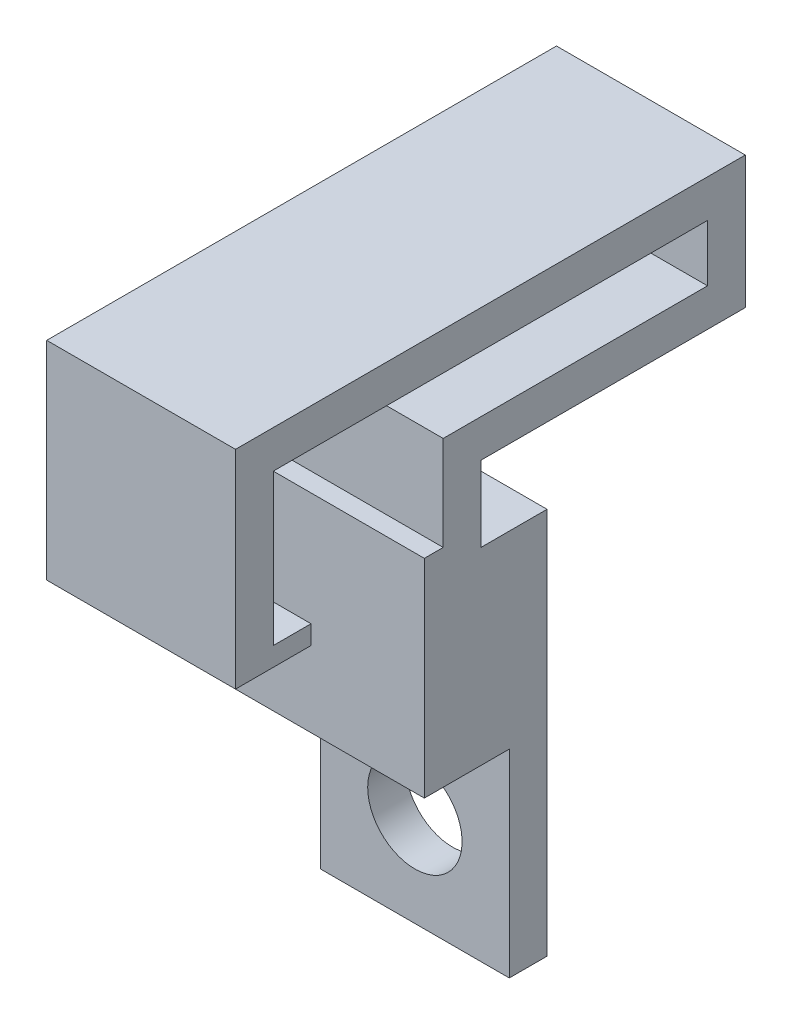
ISO-10303-21;
HEADER;
FILE_DESCRIPTION(('STEP AP214'),'2;1');
FILE_NAME('part.step','',(''),(''),'','','');
FILE_SCHEMA(('AUTOMOTIVE_DESIGN { 1 0 10303 214 1 1 1 1 }'));
ENDSEC;
DATA;
#1=APPLICATION_CONTEXT('core data for automotive mechanical design processes');
#2=APPLICATION_PROTOCOL_DEFINITION('international standard','automotive_design',2000,#1);
#3=PRODUCT_CONTEXT('',#1,'mechanical');
#4=PRODUCT('Part','Part','',(#3));
#5=PRODUCT_RELATED_PRODUCT_CATEGORY('part','',(#4));
#6=PRODUCT_DEFINITION_FORMATION('','',#4);
#7=PRODUCT_DEFINITION_CONTEXT('part definition',#1,'design');
#8=PRODUCT_DEFINITION('design','',#6,#7);
#9=PRODUCT_DEFINITION_SHAPE('','',#8);
#10=(LENGTH_UNIT() NAMED_UNIT(*) SI_UNIT(.MILLI.,.METRE.));
#11=(NAMED_UNIT(*) PLANE_ANGLE_UNIT() SI_UNIT($,.RADIAN.));
#12=(NAMED_UNIT(*) SI_UNIT($,.STERADIAN.) SOLID_ANGLE_UNIT());
#13=UNCERTAINTY_MEASURE_WITH_UNIT(LENGTH_MEASURE(1.E-05),#10,'distance_accuracy_value','');
#14=(GEOMETRIC_REPRESENTATION_CONTEXT(3) GLOBAL_UNCERTAINTY_ASSIGNED_CONTEXT((#13)) GLOBAL_UNIT_ASSIGNED_CONTEXT((#10,
#11,#12)) REPRESENTATION_CONTEXT('',''));
#15=CARTESIAN_POINT('',(0.,0.,0.));
#16=DIRECTION('',(0.,0.,1.));
#17=DIRECTION('',(1.,0.,0.));
#18=AXIS2_PLACEMENT_3D('',#15,#16,#17);
#19=CARTESIAN_POINT('',(0.,0.,-1.));
#20=DIRECTION('',(0.,0.,-1.));
#21=DIRECTION('',(-1.,0.,0.));
#22=AXIS2_PLACEMENT_3D('',#19,#20,#21);
#23=PLANE('',#22);
#24=DIRECTION('',(1.,0.,0.));
#25=VECTOR('',#24,1.);
#26=CARTESIAN_POINT('',(0.,9.,-1.));
#27=LINE('',#26,#25);
#28=CARTESIAN_POINT('',(-10.,9.,-1.));
#29=VERTEX_POINT('',#28);
#30=CARTESIAN_POINT('',(0.,9.,-1.));
#31=VERTEX_POINT('',#30);
#32=EDGE_CURVE('E302',#29,#31,#27,.T.);
#33=ORIENTED_EDGE('',*,*,#32,.F.);
#34=DIRECTION('',(0.,-1.,0.));
#35=VECTOR('',#34,1.);
#36=CARTESIAN_POINT('',(-10.,0.,-1.));
#37=LINE('',#36,#35);
#38=CARTESIAN_POINT('',(-10.,13.,-1.));
#39=VERTEX_POINT('',#38);
#40=EDGE_CURVE('E270',#39,#29,#37,.T.);
#41=ORIENTED_EDGE('',*,*,#40,.F.);
#42=DIRECTION('',(1.,0.,0.));
#43=VECTOR('',#42,1.);
#44=CARTESIAN_POINT('',(0.,13.,-1.));
#45=LINE('',#44,#43);
#46=CARTESIAN_POINT('',(0.,13.,-1.));
#47=VERTEX_POINT('',#46);
#48=EDGE_CURVE('E380',#39,#47,#45,.T.);
#49=ORIENTED_EDGE('',*,*,#48,.T.);
#50=DIRECTION('',(0.,-1.,0.));
#51=VECTOR('',#50,1.);
#52=CARTESIAN_POINT('',(0.,13.,-1.));
#53=LINE('',#52,#51);
#54=EDGE_CURVE('E377',#47,#31,#53,.T.);
#55=ORIENTED_EDGE('',*,*,#54,.T.);
#56=EDGE_LOOP('',(#33,#41,#49,#55));
#57=FACE_BOUND('',#56,.T.);
#58=ADVANCED_FACE('F41',(#57),#23,.T.);
#59=CARTESIAN_POINT('',(-10.,9.,10.));
#60=DIRECTION('',(0.,0.,1.));
#61=DIRECTION('',(1.,0.,0.));
#62=AXIS2_PLACEMENT_3D('',#59,#60,#61);
#63=PLANE('',#62);
#64=DIRECTION('',(0.,-1.,0.));
#65=VECTOR('',#64,1.);
#66=CARTESIAN_POINT('',(-10.,0.,10.));
#67=LINE('',#66,#65);
#68=CARTESIAN_POINT('',(-10.,18.,10.));
#69=VERTEX_POINT('',#68);
#70=CARTESIAN_POINT('',(-10.,10.,10.));
#71=VERTEX_POINT('',#70);
#72=EDGE_CURVE('E246',#69,#71,#67,.T.);
#73=ORIENTED_EDGE('',*,*,#72,.F.);
#74=DIRECTION('',(1.,0.,0.));
#75=VECTOR('',#74,1.);
#76=CARTESIAN_POINT('',(-10.,18.,10.));
#77=LINE('',#76,#75);
#78=CARTESIAN_POINT('',(0.,18.,10.));
#79=VERTEX_POINT('',#78);
#80=EDGE_CURVE('E365',#69,#79,#77,.T.);
#81=ORIENTED_EDGE('',*,*,#80,.T.);
#82=DIRECTION('',(0.,1.,0.));
#83=VECTOR('',#82,1.);
#84=CARTESIAN_POINT('',(0.,9.,10.));
#85=LINE('',#84,#83);
#86=CARTESIAN_POINT('',(0.,10.,10.));
#87=VERTEX_POINT('',#86);
#88=EDGE_CURVE('E215',#87,#79,#85,.T.);
#89=ORIENTED_EDGE('',*,*,#88,.F.);
#90=DIRECTION('',(1.,0.,0.));
#91=VECTOR('',#90,1.);
#92=CARTESIAN_POINT('',(0.,10.,10.));
#93=LINE('',#92,#91);
#94=EDGE_CURVE('E321',#71,#87,#93,.T.);
#95=ORIENTED_EDGE('',*,*,#94,.F.);
#96=EDGE_LOOP('',(#73,#81,#89,#95));
#97=FACE_BOUND('',#96,.T.);
#98=ADVANCED_FACE('F444',(#97),#63,.F.);
#99=CARTESIAN_POINT('',(-10.,18.,11.));
#100=DIRECTION('',(0.,1.,0.));
#101=DIRECTION('',(0.,0.,1.));
#102=AXIS2_PLACEMENT_3D('',#99,#100,#101);
#103=PLANE('',#102);
#104=DIRECTION('',(0.,0.,-1.));
#105=VECTOR('',#104,1.);
#106=CARTESIAN_POINT('',(-10.,18.,0.));
#107=LINE('',#106,#105);
#108=CARTESIAN_POINT('',(-10.,18.,-13.));
#109=VERTEX_POINT('',#108);
#110=EDGE_CURVE('E240',#69,#109,#107,.T.);
#111=ORIENTED_EDGE('',*,*,#110,.T.);
#112=DIRECTION('',(1.,0.,0.));
#113=VECTOR('',#112,1.);
#114=CARTESIAN_POINT('',(-10.,18.,-13.));
#115=LINE('',#114,#113);
#116=CARTESIAN_POINT('',(0.,18.,-13.));
#117=VERTEX_POINT('',#116);
#118=EDGE_CURVE('E210',#109,#117,#115,.T.);
#119=ORIENTED_EDGE('',*,*,#118,.T.);
#120=DIRECTION('',(0.,0.,-1.));
#121=VECTOR('',#120,1.);
#122=CARTESIAN_POINT('',(0.,18.,11.));
#123=LINE('',#122,#121);
#124=EDGE_CURVE('E214',#79,#117,#123,.T.);
#125=ORIENTED_EDGE('',*,*,#124,.F.);
#126=ORIENTED_EDGE('',*,*,#80,.F.);
#127=EDGE_LOOP('',(#111,#119,#125,#126));
#128=FACE_BOUND('',#127,.T.);
#129=ADVANCED_FACE('F450',(#128),#103,.F.);
#130=CARTESIAN_POINT('',(0.,10.,2.));
#131=DIRECTION('',(0.,-1.,0.));
#132=DIRECTION('',(1.,0.,0.));
#133=AXIS2_PLACEMENT_3D('',#130,#131,#132);
#134=PLANE('',#133);
#135=DIRECTION('',(0.,0.,-1.));
#136=VECTOR('',#135,1.);
#137=CARTESIAN_POINT('',(-10.,10.,0.));
#138=LINE('',#137,#136);
#139=CARTESIAN_POINT('',(-10.,10.,2.));
#140=VERTEX_POINT('',#139);
#141=CARTESIAN_POINT('',(-10.,10.,0.999999999999999));
#142=VERTEX_POINT('',#141);
#143=EDGE_CURVE('E180',#140,#142,#138,.T.);
#144=ORIENTED_EDGE('',*,*,#143,.F.);
#145=DIRECTION('',(-1.,0.,0.));
#146=VECTOR('',#145,1.);
#147=CARTESIAN_POINT('',(0.,10.,2.));
#148=LINE('',#147,#146);
#149=CARTESIAN_POINT('',(0.,10.,2.));
#150=VERTEX_POINT('',#149);
#151=EDGE_CURVE('E52',#150,#140,#148,.T.);
#152=ORIENTED_EDGE('',*,*,#151,.F.);
#153=DIRECTION('',(0.,0.,-1.));
#154=VECTOR('',#153,1.);
#155=CARTESIAN_POINT('',(0.,10.,2.));
#156=LINE('',#155,#154);
#157=CARTESIAN_POINT('',(0.,10.,0.999999999999999));
#158=VERTEX_POINT('',#157);
#159=EDGE_CURVE('E11',#150,#158,#156,.T.);
#160=ORIENTED_EDGE('',*,*,#159,.T.);
#161=DIRECTION('',(1.,0.,0.));
#162=VECTOR('',#161,1.);
#163=CARTESIAN_POINT('',(-10.,10.,0.999999999999999));
#164=LINE('',#163,#162);
#165=EDGE_CURVE('E208',#142,#158,#164,.T.);
#166=ORIENTED_EDGE('',*,*,#165,.F.);
#167=EDGE_LOOP('',(#144,#152,#160,#166));
#168=FACE_BOUND('',#167,.T.);
#169=ADVANCED_FACE('F176',(#168),#134,.F.);
#170=CARTESIAN_POINT('',(0.,0.,2.));
#171=DIRECTION('',(0.,0.,1.));
#172=DIRECTION('',(1.,0.,0.));
#173=AXIS2_PLACEMENT_3D('',#170,#171,#172);
#174=PLANE('',#173);
#175=ORIENTED_EDGE('',*,*,#151,.T.);
#176=DIRECTION('',(0.,1.,0.));
#177=VECTOR('',#176,1.);
#178=CARTESIAN_POINT('',(-10.,0.,2.));
#179=LINE('',#178,#177);
#180=CARTESIAN_POINT('',(-10.,-1.00000000000001,2.));
#181=VERTEX_POINT('',#180);
#182=EDGE_CURVE('E242',#181,#140,#179,.T.);
#183=ORIENTED_EDGE('',*,*,#182,.F.);
#184=DIRECTION('',(-1.,0.,0.));
#185=VECTOR('',#184,1.);
#186=CARTESIAN_POINT('',(0.,-1.,2.));
#187=LINE('',#186,#185);
#188=CARTESIAN_POINT('',(0.,-1.,2.));
#189=VERTEX_POINT('',#188);
#190=EDGE_CURVE('E190',#189,#181,#187,.T.);
#191=ORIENTED_EDGE('',*,*,#190,.F.);
#192=DIRECTION('',(0.,1.,0.));
#193=VECTOR('',#192,1.);
#194=CARTESIAN_POINT('',(0.,0.,2.));
#195=LINE('',#194,#193);
#196=EDGE_CURVE('E184',#189,#150,#195,.T.);
#197=ORIENTED_EDGE('',*,*,#196,.T.);
#198=EDGE_LOOP('',(#175,#183,#191,#197));
#199=FACE_BOUND('',#198,.T.);
#200=ADVANCED_FACE('F188',(#199),#174,.T.);
#201=CARTESIAN_POINT('',(-10.,15.,0.999999999999999));
#202=DIRECTION('',(0.,0.,-1.));
#203=DIRECTION('',(-1.,0.,0.));
#204=AXIS2_PLACEMENT_3D('',#201,#202,#203);
#205=PLANE('',#204);
#206=DIRECTION('',(0.,1.,0.));
#207=VECTOR('',#206,1.);
#208=CARTESIAN_POINT('',(-10.,0.,0.999999999999999));
#209=LINE('',#208,#207);
#210=CARTESIAN_POINT('',(-10.,15.,0.999999999999999));
#211=VERTEX_POINT('',#210);
#212=EDGE_CURVE('E80',#142,#211,#209,.T.);
#213=ORIENTED_EDGE('',*,*,#212,.F.);
#214=ORIENTED_EDGE('',*,*,#165,.T.);
#215=DIRECTION('',(0.,-1.,0.));
#216=VECTOR('',#215,1.);
#217=CARTESIAN_POINT('',(0.,15.,0.999999999999999));
#218=LINE('',#217,#216);
#219=CARTESIAN_POINT('',(0.,15.,0.999999999999999));
#220=VERTEX_POINT('',#219);
#221=EDGE_CURVE('E194',#220,#158,#218,.T.);
#222=ORIENTED_EDGE('',*,*,#221,.F.);
#223=DIRECTION('',(1.,0.,0.));
#224=VECTOR('',#223,1.);
#225=CARTESIAN_POINT('',(-10.,15.,0.999999999999999));
#226=LINE('',#225,#224);
#227=EDGE_CURVE('E205',#211,#220,#226,.T.);
#228=ORIENTED_EDGE('',*,*,#227,.F.);
#229=EDGE_LOOP('',(#213,#214,#222,#228));
#230=FACE_BOUND('',#229,.T.);
#231=ADVANCED_FACE('F235',(#230),#205,.F.);
#232=CARTESIAN_POINT('',(0.,15.,0.));
#233=DIRECTION('',(0.,1.,0.));
#234=DIRECTION('',(-1.,0.,0.));
#235=AXIS2_PLACEMENT_3D('',#232,#233,#234);
#236=PLANE('',#235);
#237=DIRECTION('',(1.,0.,0.));
#238=VECTOR('',#237,1.);
#239=CARTESIAN_POINT('',(-10.,15.,-13.));
#240=LINE('',#239,#238);
#241=CARTESIAN_POINT('',(-10.,15.,-13.));
#242=VERTEX_POINT('',#241);
#243=CARTESIAN_POINT('',(0.,15.,-13.));
#244=VERTEX_POINT('',#243);
#245=EDGE_CURVE('E216',#242,#244,#240,.T.);
#246=ORIENTED_EDGE('',*,*,#245,.F.);
#247=DIRECTION('',(0.,0.,-1.));
#248=VECTOR('',#247,1.);
#249=CARTESIAN_POINT('',(-10.,15.,0.));
#250=LINE('',#249,#248);
#251=EDGE_CURVE('E73',#211,#242,#250,.T.);
#252=ORIENTED_EDGE('',*,*,#251,.F.);
#253=ORIENTED_EDGE('',*,*,#227,.T.);
#254=DIRECTION('',(0.,0.,-1.));
#255=VECTOR('',#254,1.);
#256=CARTESIAN_POINT('',(0.,15.,0.));
#257=LINE('',#256,#255);
#258=EDGE_CURVE('E199',#220,#244,#257,.T.);
#259=ORIENTED_EDGE('',*,*,#258,.T.);
#260=EDGE_LOOP('',(#246,#252,#253,#259));
#261=FACE_BOUND('',#260,.T.);
#262=ADVANCED_FACE('F234',(#261),#236,.T.);
#263=CARTESIAN_POINT('',(0.,13.,0.));
#264=DIRECTION('',(0.,-1.,0.));
#265=DIRECTION('',(0.,0.,-1.));
#266=AXIS2_PLACEMENT_3D('',#263,#264,#265);
#267=PLANE('',#266);
#268=ORIENTED_EDGE('',*,*,#48,.F.);
#269=DIRECTION('',(0.,0.,1.));
#270=VECTOR('',#269,1.);
#271=CARTESIAN_POINT('',(-10.,13.,0.));
#272=LINE('',#271,#270);
#273=CARTESIAN_POINT('',(-10.,13.,-15.));
#274=VERTEX_POINT('',#273);
#275=EDGE_CURVE('E267',#274,#39,#272,.T.);
#276=ORIENTED_EDGE('',*,*,#275,.F.);
#277=DIRECTION('',(-1.,0.,0.));
#278=VECTOR('',#277,1.);
#279=CARTESIAN_POINT('',(0.,13.,-15.));
#280=LINE('',#279,#278);
#281=CARTESIAN_POINT('',(0.,13.,-15.));
#282=VERTEX_POINT('',#281);
#283=EDGE_CURVE('E354',#282,#274,#280,.T.);
#284=ORIENTED_EDGE('',*,*,#283,.F.);
#285=DIRECTION('',(0.,0.,1.));
#286=VECTOR('',#285,1.);
#287=CARTESIAN_POINT('',(0.,13.,-14.));
#288=LINE('',#287,#286);
#289=EDGE_CURVE('E220',#282,#47,#288,.T.);
#290=ORIENTED_EDGE('',*,*,#289,.T.);
#291=EDGE_LOOP('',(#268,#276,#284,#290));
#292=FACE_BOUND('',#291,.T.);
#293=ADVANCED_FACE('F390',(#292),#267,.T.);
#294=CARTESIAN_POINT('',(0.,9.,0.));
#295=DIRECTION('',(0.,-1.,0.));
#296=DIRECTION('',(0.,0.,-1.));
#297=AXIS2_PLACEMENT_3D('',#294,#295,#296);
#298=PLANE('',#297);
#299=DIRECTION('',(1.,0.,0.));
#300=VECTOR('',#299,1.);
#301=CARTESIAN_POINT('',(-10.,9.,12.));
#302=LINE('',#301,#300);
#303=CARTESIAN_POINT('',(-10.,9.,12.));
#304=VERTEX_POINT('',#303);
#305=CARTESIAN_POINT('',(0.,9.,12.));
#306=VERTEX_POINT('',#305);
#307=EDGE_CURVE('E339',#304,#306,#302,.T.);
#308=ORIENTED_EDGE('',*,*,#307,.F.);
#309=DIRECTION('',(0.,0.,1.));
#310=VECTOR('',#309,1.);
#311=CARTESIAN_POINT('',(-10.,9.,0.));
#312=LINE('',#311,#310);
#313=CARTESIAN_POINT('',(-10.,9.,8.));
#314=VERTEX_POINT('',#313);
#315=EDGE_CURVE('E255',#314,#304,#312,.T.);
#316=ORIENTED_EDGE('',*,*,#315,.F.);
#317=DIRECTION('',(-1.,0.,0.));
#318=VECTOR('',#317,1.);
#319=CARTESIAN_POINT('',(0.,9.,8.));
#320=LINE('',#319,#318);
#321=CARTESIAN_POINT('',(0.,9.,8.));
#322=VERTEX_POINT('',#321);
#323=EDGE_CURVE('E326',#322,#314,#320,.T.);
#324=ORIENTED_EDGE('',*,*,#323,.F.);
#325=DIRECTION('',(0.,0.,1.));
#326=VECTOR('',#325,1.);
#327=CARTESIAN_POINT('',(0.,9.,11.));
#328=LINE('',#327,#326);
#329=EDGE_CURVE('E366',#322,#306,#328,.T.);
#330=ORIENTED_EDGE('',*,*,#329,.T.);
#331=EDGE_LOOP('',(#308,#316,#324,#330));
#332=FACE_BOUND('',#331,.T.);
#333=ADVANCED_FACE('F457',(#332),#298,.T.);
#334=CARTESIAN_POINT('',(0.,20.,0.));
#335=DIRECTION('',(0.,1.,0.));
#336=DIRECTION('',(-1.,0.,0.));
#337=AXIS2_PLACEMENT_3D('',#334,#335,#336);
#338=PLANE('',#337);
#339=DIRECTION('',(1.,0.,0.));
#340=VECTOR('',#339,1.);
#341=CARTESIAN_POINT('',(0.,20.,-15.));
#342=LINE('',#341,#340);
#343=CARTESIAN_POINT('',(-10.,20.,-15.));
#344=VERTEX_POINT('',#343);
#345=CARTESIAN_POINT('',(0.,20.,-15.));
#346=VERTEX_POINT('',#345);
#347=EDGE_CURVE('E358',#344,#346,#342,.T.);
#348=ORIENTED_EDGE('',*,*,#347,.F.);
#349=DIRECTION('',(0.,0.,-1.));
#350=VECTOR('',#349,1.);
#351=CARTESIAN_POINT('',(-10.,20.,0.));
#352=LINE('',#351,#350);
#353=CARTESIAN_POINT('',(-10.,20.,12.));
#354=VERTEX_POINT('',#353);
#355=EDGE_CURVE('E261',#354,#344,#352,.T.);
#356=ORIENTED_EDGE('',*,*,#355,.F.);
#357=DIRECTION('',(-1.,0.,0.));
#358=VECTOR('',#357,1.);
#359=CARTESIAN_POINT('',(-10.,20.,12.));
#360=LINE('',#359,#358);
#361=CARTESIAN_POINT('',(0.,20.,12.));
#362=VERTEX_POINT('',#361);
#363=EDGE_CURVE('E346',#362,#354,#360,.T.);
#364=ORIENTED_EDGE('',*,*,#363,.F.);
#365=DIRECTION('',(0.,0.,-1.));
#366=VECTOR('',#365,1.);
#367=CARTESIAN_POINT('',(0.,20.,-14.));
#368=LINE('',#367,#366);
#369=EDGE_CURVE('E361',#362,#346,#368,.T.);
#370=ORIENTED_EDGE('',*,*,#369,.T.);
#371=EDGE_LOOP('',(#348,#356,#364,#370));
#372=FACE_BOUND('',#371,.T.);
#373=ADVANCED_FACE('F499',(#372),#338,.T.);
#374=CARTESIAN_POINT('',(0.,0.,-15.));
#375=DIRECTION('',(0.,0.,1.));
#376=DIRECTION('',(1.,0.,0.));
#377=AXIS2_PLACEMENT_3D('',#374,#375,#376);
#378=PLANE('',#377);
#379=DIRECTION('',(0.,-1.,0.));
#380=VECTOR('',#379,1.);
#381=CARTESIAN_POINT('',(-10.,0.,-15.));
#382=LINE('',#381,#380);
#383=EDGE_CURVE('E264',#344,#274,#382,.T.);
#384=ORIENTED_EDGE('',*,*,#383,.F.);
#385=ORIENTED_EDGE('',*,*,#347,.T.);
#386=DIRECTION('',(0.,-1.,0.));
#387=VECTOR('',#386,1.);
#388=CARTESIAN_POINT('',(0.,13.,-15.));
#389=LINE('',#388,#387);
#390=EDGE_CURVE('E350',#346,#282,#389,.T.);
#391=ORIENTED_EDGE('',*,*,#390,.T.);
#392=ORIENTED_EDGE('',*,*,#283,.T.);
#393=EDGE_LOOP('',(#384,#385,#391,#392));
#394=FACE_BOUND('',#393,.T.);
#395=ADVANCED_FACE('F501',(#394),#378,.F.);
#396=CARTESIAN_POINT('',(0.,0.,12.));
#397=DIRECTION('',(0.,0.,1.));
#398=DIRECTION('',(1.,0.,0.));
#399=AXIS2_PLACEMENT_3D('',#396,#397,#398);
#400=PLANE('',#399);
#401=ORIENTED_EDGE('',*,*,#363,.T.);
#402=DIRECTION('',(0.,1.,0.));
#403=VECTOR('',#402,1.);
#404=CARTESIAN_POINT('',(-10.,0.,12.));
#405=LINE('',#404,#403);
#406=EDGE_CURVE('E258',#304,#354,#405,.T.);
#407=ORIENTED_EDGE('',*,*,#406,.F.);
#408=ORIENTED_EDGE('',*,*,#307,.T.);
#409=DIRECTION('',(0.,1.,0.));
#410=VECTOR('',#409,1.);
#411=CARTESIAN_POINT('',(0.,20.,12.));
#412=LINE('',#411,#410);
#413=EDGE_CURVE('E342',#306,#362,#412,.T.);
#414=ORIENTED_EDGE('',*,*,#413,.T.);
#415=EDGE_LOOP('',(#401,#407,#408,#414));
#416=FACE_BOUND('',#415,.T.);
#417=ADVANCED_FACE('F493',(#416),#400,.T.);
#418=CARTESIAN_POINT('',(0.,10.,8.));
#419=DIRECTION('',(0.,-1.,0.));
#420=DIRECTION('',(0.,0.,-1.));
#421=AXIS2_PLACEMENT_3D('',#418,#419,#420);
#422=PLANE('',#421);
#423=DIRECTION('',(0.,0.,-1.));
#424=VECTOR('',#423,1.);
#425=CARTESIAN_POINT('',(-10.,10.,0.));
#426=LINE('',#425,#424);
#427=CARTESIAN_POINT('',(-10.,10.,8.));
#428=VERTEX_POINT('',#427);
#429=EDGE_CURVE('E249',#71,#428,#426,.T.);
#430=ORIENTED_EDGE('',*,*,#429,.F.);
#431=ORIENTED_EDGE('',*,*,#94,.T.);
#432=DIRECTION('',(0.,0.,1.));
#433=VECTOR('',#432,1.);
#434=CARTESIAN_POINT('',(0.,10.,8.));
#435=LINE('',#434,#433);
#436=CARTESIAN_POINT('',(0.,10.,8.));
#437=VERTEX_POINT('',#436);
#438=EDGE_CURVE('E333',#437,#87,#435,.T.);
#439=ORIENTED_EDGE('',*,*,#438,.F.);
#440=DIRECTION('',(1.,0.,0.));
#441=VECTOR('',#440,1.);
#442=CARTESIAN_POINT('',(0.,10.,8.));
#443=LINE('',#442,#441);
#444=EDGE_CURVE('E330',#428,#437,#443,.T.);
#445=ORIENTED_EDGE('',*,*,#444,.F.);
#446=EDGE_LOOP('',(#430,#431,#439,#445));
#447=FACE_BOUND('',#446,.T.);
#448=ADVANCED_FACE('F440',(#447),#422,.F.);
#449=CARTESIAN_POINT('',(0.,0.,8.));
#450=DIRECTION('',(0.,0.,1.));
#451=DIRECTION('',(1.,0.,0.));
#452=AXIS2_PLACEMENT_3D('',#449,#450,#451);
#453=PLANE('',#452);
#454=DIRECTION('',(0.,-1.,0.));
#455=VECTOR('',#454,1.);
#456=CARTESIAN_POINT('',(-10.,0.,8.));
#457=LINE('',#456,#455);
#458=EDGE_CURVE('E252',#428,#314,#457,.T.);
#459=ORIENTED_EDGE('',*,*,#458,.F.);
#460=ORIENTED_EDGE('',*,*,#444,.T.);
#461=DIRECTION('',(0.,-1.,0.));
#462=VECTOR('',#461,1.);
#463=CARTESIAN_POINT('',(0.,9.,8.));
#464=LINE('',#463,#462);
#465=EDGE_CURVE('E322',#437,#322,#464,.T.);
#466=ORIENTED_EDGE('',*,*,#465,.T.);
#467=ORIENTED_EDGE('',*,*,#323,.T.);
#468=EDGE_LOOP('',(#459,#460,#466,#467));
#469=FACE_BOUND('',#468,.T.);
#470=ADVANCED_FACE('F433',(#469),#453,.F.);
#471=CARTESIAN_POINT('',(0.,-1.,0.));
#472=DIRECTION('',(0.,-1.,0.));
#473=DIRECTION('',(1.,0.,0.));
#474=AXIS2_PLACEMENT_3D('',#471,#472,#473);
#475=PLANE('',#474);
#476=ORIENTED_EDGE('',*,*,#190,.T.);
#477=DIRECTION('',(0.,0.,1.));
#478=VECTOR('',#477,1.);
#479=CARTESIAN_POINT('',(-10.,-1.00000000000001,0.));
#480=LINE('',#479,#478);
#481=CARTESIAN_POINT('',(-10.,-1.00000000000001,-2.5));
#482=VERTEX_POINT('',#481);
#483=EDGE_CURVE('E417',#482,#181,#480,.T.);
#484=ORIENTED_EDGE('',*,*,#483,.F.);
#485=DIRECTION('',(-1.,0.,0.));
#486=VECTOR('',#485,1.);
#487=CARTESIAN_POINT('',(0.,-1.,-2.5));
#488=LINE('',#487,#486);
#489=CARTESIAN_POINT('',(0.,-1.,-2.5));
#490=VERTEX_POINT('',#489);
#491=EDGE_CURVE('E281',#490,#482,#488,.T.);
#492=ORIENTED_EDGE('',*,*,#491,.F.);
#493=DIRECTION('',(0.,0.,1.));
#494=VECTOR('',#493,1.);
#495=CARTESIAN_POINT('',(0.,-1.,-1.));
#496=LINE('',#495,#494);
#497=EDGE_CURVE('E316',#490,#189,#496,.T.);
#498=ORIENTED_EDGE('',*,*,#497,.T.);
#499=EDGE_LOOP('',(#476,#484,#492,#498));
#500=FACE_BOUND('',#499,.T.);
#501=ADVANCED_FACE('F430',(#500),#475,.T.);
#502=CARTESIAN_POINT('',(0.,9.,-4.5));
#503=DIRECTION('',(0.,-1.,0.));
#504=DIRECTION('',(0.,0.,-1.));
#505=AXIS2_PLACEMENT_3D('',#502,#503,#504);
#506=PLANE('',#505);
#507=DIRECTION('',(0.,0.,-1.));
#508=VECTOR('',#507,1.);
#509=CARTESIAN_POINT('',(-10.,9.,0.));
#510=LINE('',#509,#508);
#511=CARTESIAN_POINT('',(-10.,9.,-4.5));
#512=VERTEX_POINT('',#511);
#513=EDGE_CURVE('E273',#29,#512,#510,.T.);
#514=ORIENTED_EDGE('',*,*,#513,.F.);
#515=ORIENTED_EDGE('',*,*,#32,.T.);
#516=DIRECTION('',(0.,0.,1.));
#517=VECTOR('',#516,1.);
#518=CARTESIAN_POINT('',(0.,9.,-4.5));
#519=LINE('',#518,#517);
#520=CARTESIAN_POINT('',(0.,9.,-4.5));
#521=VERTEX_POINT('',#520);
#522=EDGE_CURVE('E310',#521,#31,#519,.T.);
#523=ORIENTED_EDGE('',*,*,#522,.F.);
#524=DIRECTION('',(1.,0.,0.));
#525=VECTOR('',#524,1.);
#526=CARTESIAN_POINT('',(0.,9.,-4.5));
#527=LINE('',#526,#525);
#528=EDGE_CURVE('E307',#512,#521,#527,.T.);
#529=ORIENTED_EDGE('',*,*,#528,.F.);
#530=EDGE_LOOP('',(#514,#515,#523,#529));
#531=FACE_BOUND('',#530,.T.);
#532=ADVANCED_FACE('F398',(#531),#506,.F.);
#533=CARTESIAN_POINT('',(0.,0.,-4.5));
#534=DIRECTION('',(0.,0.,1.));
#535=DIRECTION('',(1.,0.,0.));
#536=AXIS2_PLACEMENT_3D('',#533,#534,#535);
#537=PLANE('',#536);
#538=CARTESIAN_POINT('',(-5.,-6.5,-4.5));
#539=DIRECTION('',(0.,0.,-1.));
#540=DIRECTION('',(-1.,0.,0.));
#541=AXIS2_PLACEMENT_3D('',#538,#539,#540);
#542=CIRCLE('',#541,2.5);
#543=CARTESIAN_POINT('',(-7.5,-6.5,-4.5));
#544=VERTEX_POINT('',#543);
#545=EDGE_CURVE('E423',#544,#544,#542,.T.);
#546=ORIENTED_EDGE('',*,*,#545,.F.);
#547=EDGE_LOOP('',(#546));
#548=FACE_BOUND('',#547,.T.);
#549=DIRECTION('',(0.,-1.,0.));
#550=VECTOR('',#549,1.);
#551=CARTESIAN_POINT('',(-10.,0.,-4.5));
#552=LINE('',#551,#550);
#553=CARTESIAN_POINT('',(-10.,-11.5,-4.5));
#554=VERTEX_POINT('',#553);
#555=EDGE_CURVE('E61',#512,#554,#552,.T.);
#556=ORIENTED_EDGE('',*,*,#555,.F.);
#557=ORIENTED_EDGE('',*,*,#528,.T.);
#558=DIRECTION('',(0.,-1.,0.));
#559=VECTOR('',#558,1.);
#560=CARTESIAN_POINT('',(0.,-1.,-4.5));
#561=LINE('',#560,#559);
#562=CARTESIAN_POINT('',(0.,-11.5,-4.5));
#563=VERTEX_POINT('',#562);
#564=EDGE_CURVE('E303',#521,#563,#561,.T.);
#565=ORIENTED_EDGE('',*,*,#564,.T.);
#566=DIRECTION('',(1.,0.,0.));
#567=VECTOR('',#566,1.);
#568=CARTESIAN_POINT('',(0.,-11.5,-4.5));
#569=LINE('',#568,#567);
#570=EDGE_CURVE('E292',#554,#563,#569,.T.);
#571=ORIENTED_EDGE('',*,*,#570,.F.);
#572=EDGE_LOOP('',(#556,#557,#565,#571));
#573=FACE_BOUND('',#572,.T.);
#574=ADVANCED_FACE('F404',(#548,#573),#537,.F.);
#575=CARTESIAN_POINT('',(0.,-11.5,-2.5));
#576=DIRECTION('',(0.,0.,-1.));
#577=DIRECTION('',(-1.,0.,0.));
#578=AXIS2_PLACEMENT_3D('',#575,#576,#577);
#579=PLANE('',#578);
#580=CARTESIAN_POINT('',(-5.,-6.5,-2.5));
#581=DIRECTION('',(0.,0.,-1.));
#582=DIRECTION('',(-1.,0.,0.));
#583=AXIS2_PLACEMENT_3D('',#580,#581,#582);
#584=CIRCLE('',#583,2.5);
#585=CARTESIAN_POINT('',(-7.5,-6.5,-2.5));
#586=VERTEX_POINT('',#585);
#587=EDGE_CURVE('E45',#586,#586,#584,.T.);
#588=ORIENTED_EDGE('',*,*,#587,.T.);
#589=EDGE_LOOP('',(#588));
#590=FACE_BOUND('',#589,.T.);
#591=DIRECTION('',(0.,1.,0.));
#592=VECTOR('',#591,1.);
#593=CARTESIAN_POINT('',(-10.,0.,-2.5));
#594=LINE('',#593,#592);
#595=CARTESIAN_POINT('',(-10.,-11.5,-2.5));
#596=VERTEX_POINT('',#595);
#597=EDGE_CURVE('E412',#596,#482,#594,.T.);
#598=ORIENTED_EDGE('',*,*,#597,.F.);
#599=DIRECTION('',(-1.,0.,0.));
#600=VECTOR('',#599,1.);
#601=CARTESIAN_POINT('',(0.,-11.5,-2.5));
#602=LINE('',#601,#600);
#603=CARTESIAN_POINT('',(0.,-11.5,-2.5));
#604=VERTEX_POINT('',#603);
#605=EDGE_CURVE('E288',#604,#596,#602,.T.);
#606=ORIENTED_EDGE('',*,*,#605,.F.);
#607=DIRECTION('',(0.,1.,0.));
#608=VECTOR('',#607,1.);
#609=CARTESIAN_POINT('',(0.,-11.5,-2.5));
#610=LINE('',#609,#608);
#611=EDGE_CURVE('E295',#604,#490,#610,.T.);
#612=ORIENTED_EDGE('',*,*,#611,.T.);
#613=ORIENTED_EDGE('',*,*,#491,.T.);
#614=EDGE_LOOP('',(#598,#606,#612,#613));
#615=FACE_BOUND('',#614,.T.);
#616=ADVANCED_FACE('F415',(#590,#615),#579,.F.);
#617=CARTESIAN_POINT('',(0.,-11.5,0.));
#618=DIRECTION('',(0.,-1.,0.));
#619=DIRECTION('',(1.,0.,0.));
#620=AXIS2_PLACEMENT_3D('',#617,#618,#619);
#621=PLANE('',#620);
#622=ORIENTED_EDGE('',*,*,#605,.T.);
#623=DIRECTION('',(0.,0.,1.));
#624=VECTOR('',#623,1.);
#625=CARTESIAN_POINT('',(-10.,-11.5,0.));
#626=LINE('',#625,#624);
#627=EDGE_CURVE('E278',#554,#596,#626,.T.);
#628=ORIENTED_EDGE('',*,*,#627,.F.);
#629=ORIENTED_EDGE('',*,*,#570,.T.);
#630=DIRECTION('',(0.,0.,1.));
#631=VECTOR('',#630,1.);
#632=CARTESIAN_POINT('',(0.,-11.5,-4.5));
#633=LINE('',#632,#631);
#634=EDGE_CURVE('E284',#563,#604,#633,.T.);
#635=ORIENTED_EDGE('',*,*,#634,.T.);
#636=EDGE_LOOP('',(#622,#628,#629,#635));
#637=FACE_BOUND('',#636,.T.);
#638=ADVANCED_FACE('F407',(#637),#621,.T.);
#639=CARTESIAN_POINT('',(-10.,19.,-13.));
#640=DIRECTION('',(0.,0.,-1.));
#641=DIRECTION('',(-1.,0.,0.));
#642=AXIS2_PLACEMENT_3D('',#639,#640,#641);
#643=PLANE('',#642);
#644=ORIENTED_EDGE('',*,*,#118,.F.);
#645=DIRECTION('',(0.,1.,0.));
#646=VECTOR('',#645,1.);
#647=CARTESIAN_POINT('',(-10.,19.,-13.));
#648=LINE('',#647,#646);
#649=EDGE_CURVE('E221',#242,#109,#648,.T.);
#650=ORIENTED_EDGE('',*,*,#649,.F.);
#651=ORIENTED_EDGE('',*,*,#245,.T.);
#652=DIRECTION('',(0.,-1.,0.));
#653=VECTOR('',#652,1.);
#654=CARTESIAN_POINT('',(0.,19.,-13.));
#655=LINE('',#654,#653);
#656=EDGE_CURVE('E219',#117,#244,#655,.T.);
#657=ORIENTED_EDGE('',*,*,#656,.F.);
#658=EDGE_LOOP('',(#644,#650,#651,#657));
#659=FACE_BOUND('',#658,.T.);
#660=ADVANCED_FACE('F458',(#659),#643,.F.);
#661=CARTESIAN_POINT('',(0.,0.,2.));
#662=DIRECTION('',(-1.,0.,0.));
#663=DIRECTION('',(0.,-1.,0.));
#664=AXIS2_PLACEMENT_3D('',#661,#662,#663);
#665=PLANE('',#664);
#666=ORIENTED_EDGE('',*,*,#196,.F.);
#667=ORIENTED_EDGE('',*,*,#497,.F.);
#668=ORIENTED_EDGE('',*,*,#611,.F.);
#669=ORIENTED_EDGE('',*,*,#634,.F.);
#670=ORIENTED_EDGE('',*,*,#564,.F.);
#671=ORIENTED_EDGE('',*,*,#522,.T.);
#672=ORIENTED_EDGE('',*,*,#54,.F.);
#673=ORIENTED_EDGE('',*,*,#289,.F.);
#674=ORIENTED_EDGE('',*,*,#390,.F.);
#675=ORIENTED_EDGE('',*,*,#369,.F.);
#676=ORIENTED_EDGE('',*,*,#413,.F.);
#677=ORIENTED_EDGE('',*,*,#329,.F.);
#678=ORIENTED_EDGE('',*,*,#465,.F.);
#679=ORIENTED_EDGE('',*,*,#438,.T.);
#680=ORIENTED_EDGE('',*,*,#88,.T.);
#681=ORIENTED_EDGE('',*,*,#124,.T.);
#682=ORIENTED_EDGE('',*,*,#656,.T.);
#683=ORIENTED_EDGE('',*,*,#258,.F.);
#684=ORIENTED_EDGE('',*,*,#221,.T.);
#685=ORIENTED_EDGE('',*,*,#159,.F.);
#686=EDGE_LOOP('',(#666,#667,#668,#669,#670,#671,#672,#673,#674,#675,#676,#677,#678,#679,#680,
#681,#682,#683,#684,#685));
#687=FACE_BOUND('',#686,.T.);
#688=ADVANCED_FACE('F43',(#687),#665,.F.);
#689=CARTESIAN_POINT('',(-10.,0.,0.));
#690=DIRECTION('',(-1.,0.,0.));
#691=DIRECTION('',(0.,0.,1.));
#692=AXIS2_PLACEMENT_3D('',#689,#690,#691);
#693=PLANE('',#692);
#694=ORIENTED_EDGE('',*,*,#597,.T.);
#695=ORIENTED_EDGE('',*,*,#483,.T.);
#696=ORIENTED_EDGE('',*,*,#182,.T.);
#697=ORIENTED_EDGE('',*,*,#143,.T.);
#698=ORIENTED_EDGE('',*,*,#212,.T.);
#699=ORIENTED_EDGE('',*,*,#251,.T.);
#700=ORIENTED_EDGE('',*,*,#649,.T.);
#701=ORIENTED_EDGE('',*,*,#110,.F.);
#702=ORIENTED_EDGE('',*,*,#72,.T.);
#703=ORIENTED_EDGE('',*,*,#429,.T.);
#704=ORIENTED_EDGE('',*,*,#458,.T.);
#705=ORIENTED_EDGE('',*,*,#315,.T.);
#706=ORIENTED_EDGE('',*,*,#406,.T.);
#707=ORIENTED_EDGE('',*,*,#355,.T.);
#708=ORIENTED_EDGE('',*,*,#383,.T.);
#709=ORIENTED_EDGE('',*,*,#275,.T.);
#710=ORIENTED_EDGE('',*,*,#40,.T.);
#711=ORIENTED_EDGE('',*,*,#513,.T.);
#712=ORIENTED_EDGE('',*,*,#555,.T.);
#713=ORIENTED_EDGE('',*,*,#627,.T.);
#714=EDGE_LOOP('',(#694,#695,#696,#697,#698,#699,#700,#701,#702,#703,#704,#705,#706,#707,#708,
#709,#710,#711,#712,#713));
#715=FACE_BOUND('',#714,.T.);
#716=ADVANCED_FACE('F401',(#715),#693,.T.);
#717=CARTESIAN_POINT('',(-5.,-6.5,35.5));
#718=DIRECTION('',(0.,0.,-1.));
#719=DIRECTION('',(-1.,0.,0.));
#720=AXIS2_PLACEMENT_3D('',#717,#718,#719);
#721=CYLINDRICAL_SURFACE('',#720,2.5);
#722=ORIENTED_EDGE('',*,*,#545,.T.);
#723=EDGE_LOOP('',(#722));
#724=FACE_BOUND('',#723,.T.);
#725=ORIENTED_EDGE('',*,*,#587,.F.);
#726=EDGE_LOOP('',(#725));
#727=FACE_BOUND('',#726,.T.);
#728=ADVANCED_FACE('F592',(#724,#727),#721,.F.);
#729=CLOSED_SHELL('',(#58,#98,#129,#169,#200,#231,#262,#293,#333,#373,#395,#417,#448,#470,#501,
#532,#574,#616,#638,#660,#688,#716,#728));
#730=MANIFOLD_SOLID_BREP('B2',#729);
#731=ADVANCED_BREP_SHAPE_REPRESENTATION('',(#18,#730),#14);
#732=SHAPE_DEFINITION_REPRESENTATION(#9,#731);
ENDSEC;
END-ISO-10303-21;
